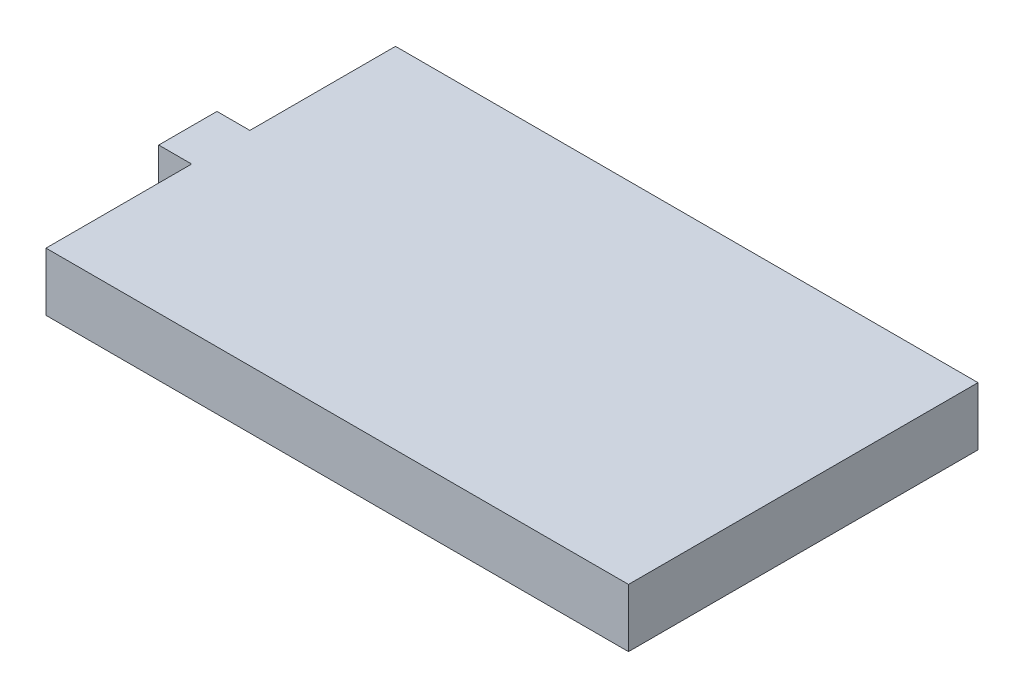
ISO-10303-21;
HEADER;
FILE_DESCRIPTION(('STEP AP214'),'2;1');
FILE_NAME('part.step','',(''),(''),'','','');
FILE_SCHEMA(('AUTOMOTIVE_DESIGN { 1 0 10303 214 1 1 1 1 }'));
ENDSEC;
DATA;
#1=APPLICATION_CONTEXT('core data for automotive mechanical design processes');
#2=APPLICATION_PROTOCOL_DEFINITION('international standard','automotive_design',2000,#1);
#3=PRODUCT_CONTEXT('',#1,'mechanical');
#4=PRODUCT('Part','Part','',(#3));
#5=PRODUCT_RELATED_PRODUCT_CATEGORY('part','',(#4));
#6=PRODUCT_DEFINITION_FORMATION('','',#4);
#7=PRODUCT_DEFINITION_CONTEXT('part definition',#1,'design');
#8=PRODUCT_DEFINITION('design','',#6,#7);
#9=PRODUCT_DEFINITION_SHAPE('','',#8);
#10=(LENGTH_UNIT() NAMED_UNIT(*) SI_UNIT(.MILLI.,.METRE.));
#11=(NAMED_UNIT(*) PLANE_ANGLE_UNIT() SI_UNIT($,.RADIAN.));
#12=(NAMED_UNIT(*) SI_UNIT($,.STERADIAN.) SOLID_ANGLE_UNIT());
#13=UNCERTAINTY_MEASURE_WITH_UNIT(LENGTH_MEASURE(1.E-05),#10,'distance_accuracy_value','');
#14=(GEOMETRIC_REPRESENTATION_CONTEXT(3) GLOBAL_UNCERTAINTY_ASSIGNED_CONTEXT((#13)) GLOBAL_UNIT_ASSIGNED_CONTEXT((#10,
#11,#12)) REPRESENTATION_CONTEXT('',''));
#15=CARTESIAN_POINT('',(0.,0.,0.));
#16=DIRECTION('',(0.,0.,1.));
#17=DIRECTION('',(1.,0.,0.));
#18=AXIS2_PLACEMENT_3D('',#15,#16,#17);
#19=CARTESIAN_POINT('',(31.75,6.35,-19.05));
#20=DIRECTION('',(0.,0.,1.));
#21=DIRECTION('',(1.,0.,0.));
#22=AXIS2_PLACEMENT_3D('',#19,#20,#21);
#23=PLANE('',#22);
#24=DIRECTION('',(-1.,0.,0.));
#25=VECTOR('',#24,1.);
#26=CARTESIAN_POINT('',(31.75,0.,-19.05));
#27=LINE('',#26,#25);
#28=CARTESIAN_POINT('',(31.75,0.,-19.05));
#29=VERTEX_POINT('',#28);
#30=CARTESIAN_POINT('',(-31.75,0.,-19.05));
#31=VERTEX_POINT('',#30);
#32=EDGE_CURVE('E130',#29,#31,#27,.T.);
#33=ORIENTED_EDGE('',*,*,#32,.T.);
#34=DIRECTION('',(0.,-1.,0.));
#35=VECTOR('',#34,1.);
#36=CARTESIAN_POINT('',(-31.75,6.35,-19.05));
#37=LINE('',#36,#35);
#38=CARTESIAN_POINT('',(-31.75,6.35,-19.05));
#39=VERTEX_POINT('',#38);
#40=EDGE_CURVE('E11',#39,#31,#37,.T.);
#41=ORIENTED_EDGE('',*,*,#40,.F.);
#42=DIRECTION('',(-1.,0.,0.));
#43=VECTOR('',#42,1.);
#44=CARTESIAN_POINT('',(31.75,6.35,-19.05));
#45=LINE('',#44,#43);
#46=CARTESIAN_POINT('',(31.75,6.35,-19.05));
#47=VERTEX_POINT('',#46);
#48=EDGE_CURVE('E144',#47,#39,#45,.T.);
#49=ORIENTED_EDGE('',*,*,#48,.F.);
#50=DIRECTION('',(0.,-1.,0.));
#51=VECTOR('',#50,1.);
#52=CARTESIAN_POINT('',(31.75,6.35,-19.05));
#53=LINE('',#52,#51);
#54=EDGE_CURVE('E126',#47,#29,#53,.T.);
#55=ORIENTED_EDGE('',*,*,#54,.T.);
#56=EDGE_LOOP('',(#33,#41,#49,#55));
#57=FACE_BOUND('',#56,.T.);
#58=ADVANCED_FACE('F34',(#57),#23,.F.);
#59=CARTESIAN_POINT('',(-31.75,6.35,-3.17499999999999));
#60=DIRECTION('',(1.,0.,0.));
#61=DIRECTION('',(0.,0.,-1.));
#62=AXIS2_PLACEMENT_3D('',#59,#60,#61);
#63=PLANE('',#62);
#64=DIRECTION('',(0.,0.,1.));
#65=VECTOR('',#64,1.);
#66=CARTESIAN_POINT('',(-31.75,0.,-3.17499999999999));
#67=LINE('',#66,#65);
#68=CARTESIAN_POINT('',(-31.75,0.,-3.17499999999999));
#69=VERTEX_POINT('',#68);
#70=EDGE_CURVE('E133',#31,#69,#67,.T.);
#71=ORIENTED_EDGE('',*,*,#70,.T.);
#72=DIRECTION('',(0.,-1.,0.));
#73=VECTOR('',#72,1.);
#74=CARTESIAN_POINT('',(-31.75,6.35,-3.17499999999999));
#75=LINE('',#74,#73);
#76=CARTESIAN_POINT('',(-31.75,6.35,-3.17499999999999));
#77=VERTEX_POINT('',#76);
#78=EDGE_CURVE('E42',#77,#69,#75,.T.);
#79=ORIENTED_EDGE('',*,*,#78,.F.);
#80=DIRECTION('',(0.,0.,1.));
#81=VECTOR('',#80,1.);
#82=CARTESIAN_POINT('',(-31.75,6.35,-3.17499999999999));
#83=LINE('',#82,#81);
#84=EDGE_CURVE('E93',#39,#77,#83,.T.);
#85=ORIENTED_EDGE('',*,*,#84,.F.);
#86=ORIENTED_EDGE('',*,*,#40,.T.);
#87=EDGE_LOOP('',(#71,#79,#85,#86));
#88=FACE_BOUND('',#87,.T.);
#89=ADVANCED_FACE('F179',(#88),#63,.F.);
#90=CARTESIAN_POINT('',(-31.75,6.35,-3.17499999999999));
#91=DIRECTION('',(0.,0.,1.));
#92=DIRECTION('',(1.,0.,0.));
#93=AXIS2_PLACEMENT_3D('',#90,#91,#92);
#94=PLANE('',#93);
#95=DIRECTION('',(-1.,0.,0.));
#96=VECTOR('',#95,1.);
#97=CARTESIAN_POINT('',(-31.75,0.,-3.17499999999999));
#98=LINE('',#97,#96);
#99=CARTESIAN_POINT('',(-35.3378766886041,0.,-3.17499999999999));
#100=VERTEX_POINT('',#99);
#101=EDGE_CURVE('E135',#69,#100,#98,.T.);
#102=ORIENTED_EDGE('',*,*,#101,.T.);
#103=DIRECTION('',(0.,-1.,0.));
#104=VECTOR('',#103,1.);
#105=CARTESIAN_POINT('',(-35.3378766886041,6.35,-3.17499999999999));
#106=LINE('',#105,#104);
#107=CARTESIAN_POINT('',(-35.3378766886041,6.35,-3.17499999999999));
#108=VERTEX_POINT('',#107);
#109=EDGE_CURVE('E151',#108,#100,#106,.T.);
#110=ORIENTED_EDGE('',*,*,#109,.F.);
#111=DIRECTION('',(-1.,0.,0.));
#112=VECTOR('',#111,1.);
#113=CARTESIAN_POINT('',(-31.75,6.35,-3.17499999999999));
#114=LINE('',#113,#112);
#115=EDGE_CURVE('E159',#77,#108,#114,.T.);
#116=ORIENTED_EDGE('',*,*,#115,.F.);
#117=ORIENTED_EDGE('',*,*,#78,.T.);
#118=EDGE_LOOP('',(#102,#110,#116,#117));
#119=FACE_BOUND('',#118,.T.);
#120=ADVANCED_FACE('F157',(#119),#94,.F.);
#121=CARTESIAN_POINT('',(-35.3378766886041,6.35,3.17500000000001));
#122=DIRECTION('',(1.,0.,0.));
#123=DIRECTION('',(0.,0.,-1.));
#124=AXIS2_PLACEMENT_3D('',#121,#122,#123);
#125=PLANE('',#124);
#126=DIRECTION('',(0.,0.,1.));
#127=VECTOR('',#126,1.);
#128=CARTESIAN_POINT('',(-35.3378766886041,0.,3.17500000000001));
#129=LINE('',#128,#127);
#130=CARTESIAN_POINT('',(-35.3378766886041,0.,3.17500000000001));
#131=VERTEX_POINT('',#130);
#132=EDGE_CURVE('E137',#100,#131,#129,.T.);
#133=ORIENTED_EDGE('',*,*,#132,.T.);
#134=DIRECTION('',(0.,-1.,0.));
#135=VECTOR('',#134,1.);
#136=CARTESIAN_POINT('',(-35.3378766886041,6.35,3.17500000000001));
#137=LINE('',#136,#135);
#138=CARTESIAN_POINT('',(-35.3378766886041,6.35,3.17500000000001));
#139=VERTEX_POINT('',#138);
#140=EDGE_CURVE('E148',#139,#131,#137,.T.);
#141=ORIENTED_EDGE('',*,*,#140,.F.);
#142=DIRECTION('',(0.,0.,1.));
#143=VECTOR('',#142,1.);
#144=CARTESIAN_POINT('',(-35.3378766886041,6.35,3.17500000000001));
#145=LINE('',#144,#143);
#146=EDGE_CURVE('E171',#108,#139,#145,.T.);
#147=ORIENTED_EDGE('',*,*,#146,.F.);
#148=ORIENTED_EDGE('',*,*,#109,.T.);
#149=EDGE_LOOP('',(#133,#141,#147,#148));
#150=FACE_BOUND('',#149,.T.);
#151=ADVANCED_FACE('F167',(#150),#125,.F.);
#152=CARTESIAN_POINT('',(-31.75,6.35,3.17500000000001));
#153=DIRECTION('',(0.,0.,-1.));
#154=DIRECTION('',(-1.,0.,0.));
#155=AXIS2_PLACEMENT_3D('',#152,#153,#154);
#156=PLANE('',#155);
#157=DIRECTION('',(1.,0.,0.));
#158=VECTOR('',#157,1.);
#159=CARTESIAN_POINT('',(-31.75,0.,3.17500000000001));
#160=LINE('',#159,#158);
#161=CARTESIAN_POINT('',(-31.75,0.,3.17500000000001));
#162=VERTEX_POINT('',#161);
#163=EDGE_CURVE('E139',#131,#162,#160,.T.);
#164=ORIENTED_EDGE('',*,*,#163,.T.);
#165=DIRECTION('',(0.,-1.,0.));
#166=VECTOR('',#165,1.);
#167=CARTESIAN_POINT('',(-31.75,6.35,3.17500000000001));
#168=LINE('',#167,#166);
#169=CARTESIAN_POINT('',(-31.75,6.35,3.17500000000001));
#170=VERTEX_POINT('',#169);
#171=EDGE_CURVE('E121',#170,#162,#168,.T.);
#172=ORIENTED_EDGE('',*,*,#171,.F.);
#173=DIRECTION('',(1.,0.,0.));
#174=VECTOR('',#173,1.);
#175=CARTESIAN_POINT('',(-31.75,6.35,3.17500000000001));
#176=LINE('',#175,#174);
#177=EDGE_CURVE('E112',#139,#170,#176,.T.);
#178=ORIENTED_EDGE('',*,*,#177,.F.);
#179=ORIENTED_EDGE('',*,*,#140,.T.);
#180=EDGE_LOOP('',(#164,#172,#178,#179));
#181=FACE_BOUND('',#180,.T.);
#182=ADVANCED_FACE('F170',(#181),#156,.F.);
#183=CARTESIAN_POINT('',(-31.75,6.35,19.05));
#184=DIRECTION('',(1.,0.,0.));
#185=DIRECTION('',(0.,0.,-1.));
#186=AXIS2_PLACEMENT_3D('',#183,#184,#185);
#187=PLANE('',#186);
#188=DIRECTION('',(0.,0.,1.));
#189=VECTOR('',#188,1.);
#190=CARTESIAN_POINT('',(-31.75,0.,19.05));
#191=LINE('',#190,#189);
#192=CARTESIAN_POINT('',(-31.75,0.,19.05));
#193=VERTEX_POINT('',#192);
#194=EDGE_CURVE('E120',#162,#193,#191,.T.);
#195=ORIENTED_EDGE('',*,*,#194,.T.);
#196=DIRECTION('',(0.,-1.,0.));
#197=VECTOR('',#196,1.);
#198=CARTESIAN_POINT('',(-31.75,6.35,19.05));
#199=LINE('',#198,#197);
#200=CARTESIAN_POINT('',(-31.75,6.35,19.05));
#201=VERTEX_POINT('',#200);
#202=EDGE_CURVE('E117',#201,#193,#199,.T.);
#203=ORIENTED_EDGE('',*,*,#202,.F.);
#204=DIRECTION('',(0.,0.,1.));
#205=VECTOR('',#204,1.);
#206=CARTESIAN_POINT('',(-31.75,6.35,19.05));
#207=LINE('',#206,#205);
#208=EDGE_CURVE('E106',#170,#201,#207,.T.);
#209=ORIENTED_EDGE('',*,*,#208,.F.);
#210=ORIENTED_EDGE('',*,*,#171,.T.);
#211=EDGE_LOOP('',(#195,#203,#209,#210));
#212=FACE_BOUND('',#211,.T.);
#213=ADVANCED_FACE('F118',(#212),#187,.F.);
#214=CARTESIAN_POINT('',(31.75,6.35,19.05));
#215=DIRECTION('',(0.,0.,-1.));
#216=DIRECTION('',(-1.,0.,0.));
#217=AXIS2_PLACEMENT_3D('',#214,#215,#216);
#218=PLANE('',#217);
#219=DIRECTION('',(1.,0.,0.));
#220=VECTOR('',#219,1.);
#221=CARTESIAN_POINT('',(31.75,0.,19.05));
#222=LINE('',#221,#220);
#223=CARTESIAN_POINT('',(31.75,0.,19.05));
#224=VERTEX_POINT('',#223);
#225=EDGE_CURVE('E79',#193,#224,#222,.T.);
#226=ORIENTED_EDGE('',*,*,#225,.T.);
#227=DIRECTION('',(0.,-1.,0.));
#228=VECTOR('',#227,1.);
#229=CARTESIAN_POINT('',(31.75,6.35,19.05));
#230=LINE('',#229,#228);
#231=CARTESIAN_POINT('',(31.75,6.35,19.05));
#232=VERTEX_POINT('',#231);
#233=EDGE_CURVE('E122',#232,#224,#230,.T.);
#234=ORIENTED_EDGE('',*,*,#233,.F.);
#235=DIRECTION('',(1.,0.,0.));
#236=VECTOR('',#235,1.);
#237=CARTESIAN_POINT('',(31.75,6.35,19.05));
#238=LINE('',#237,#236);
#239=EDGE_CURVE('E110',#201,#232,#238,.T.);
#240=ORIENTED_EDGE('',*,*,#239,.F.);
#241=ORIENTED_EDGE('',*,*,#202,.T.);
#242=EDGE_LOOP('',(#226,#234,#240,#241));
#243=FACE_BOUND('',#242,.T.);
#244=ADVANCED_FACE('F124',(#243),#218,.F.);
#245=CARTESIAN_POINT('',(31.75,6.35,19.05));
#246=DIRECTION('',(-1.,0.,0.));
#247=DIRECTION('',(0.,0.,1.));
#248=AXIS2_PLACEMENT_3D('',#245,#246,#247);
#249=PLANE('',#248);
#250=DIRECTION('',(0.,0.,-1.));
#251=VECTOR('',#250,1.);
#252=CARTESIAN_POINT('',(31.75,0.,19.05));
#253=LINE('',#252,#251);
#254=EDGE_CURVE('E85',#224,#29,#253,.T.);
#255=ORIENTED_EDGE('',*,*,#254,.T.);
#256=ORIENTED_EDGE('',*,*,#54,.F.);
#257=DIRECTION('',(0.,0.,-1.));
#258=VECTOR('',#257,1.);
#259=CARTESIAN_POINT('',(31.75,6.35,19.05));
#260=LINE('',#259,#258);
#261=EDGE_CURVE('E50',#232,#47,#260,.T.);
#262=ORIENTED_EDGE('',*,*,#261,.F.);
#263=ORIENTED_EDGE('',*,*,#233,.T.);
#264=EDGE_LOOP('',(#255,#256,#262,#263));
#265=FACE_BOUND('',#264,.T.);
#266=ADVANCED_FACE('F195',(#265),#249,.F.);
#267=CARTESIAN_POINT('',(0.,6.35,0.));
#268=DIRECTION('',(0.,-1.,0.));
#269=DIRECTION('',(0.,0.,-1.));
#270=AXIS2_PLACEMENT_3D('',#267,#268,#269);
#271=PLANE('',#270);
#272=ORIENTED_EDGE('',*,*,#48,.T.);
#273=ORIENTED_EDGE('',*,*,#84,.T.);
#274=ORIENTED_EDGE('',*,*,#115,.T.);
#275=ORIENTED_EDGE('',*,*,#146,.T.);
#276=ORIENTED_EDGE('',*,*,#177,.T.);
#277=ORIENTED_EDGE('',*,*,#208,.T.);
#278=ORIENTED_EDGE('',*,*,#239,.T.);
#279=ORIENTED_EDGE('',*,*,#261,.T.);
#280=EDGE_LOOP('',(#272,#273,#274,#275,#276,#277,#278,#279));
#281=FACE_BOUND('',#280,.T.);
#282=ADVANCED_FACE('F108',(#281),#271,.F.);
#283=CARTESIAN_POINT('',(0.,0.,0.));
#284=DIRECTION('',(0.,-1.,0.));
#285=DIRECTION('',(0.,0.,-1.));
#286=AXIS2_PLACEMENT_3D('',#283,#284,#285);
#287=PLANE('',#286);
#288=ORIENTED_EDGE('',*,*,#32,.F.);
#289=ORIENTED_EDGE('',*,*,#254,.F.);
#290=ORIENTED_EDGE('',*,*,#225,.F.);
#291=ORIENTED_EDGE('',*,*,#194,.F.);
#292=ORIENTED_EDGE('',*,*,#163,.F.);
#293=ORIENTED_EDGE('',*,*,#132,.F.);
#294=ORIENTED_EDGE('',*,*,#101,.F.);
#295=ORIENTED_EDGE('',*,*,#70,.F.);
#296=EDGE_LOOP('',(#288,#289,#290,#291,#292,#293,#294,#295));
#297=FACE_BOUND('',#296,.T.);
#298=ADVANCED_FACE('F163',(#297),#287,.T.);
#299=CLOSED_SHELL('',(#58,#89,#120,#151,#182,#213,#244,#266,#282,#298));
#300=MANIFOLD_SOLID_BREP('B2',#299);
#301=ADVANCED_BREP_SHAPE_REPRESENTATION('',(#18,#300),#14);
#302=SHAPE_DEFINITION_REPRESENTATION(#9,#301);
ENDSEC;
END-ISO-10303-21;
